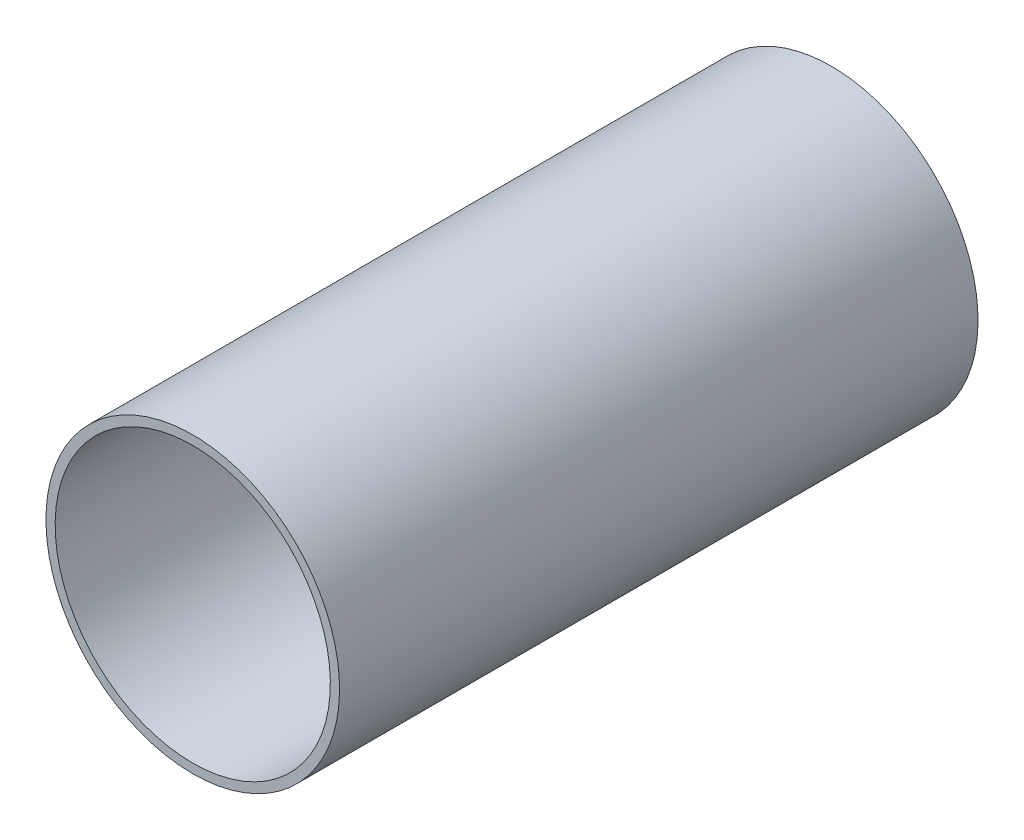
ISO-10303-21;
HEADER;
FILE_DESCRIPTION(('STEP AP214'),'2;1');
FILE_NAME('part.step','',(''),(''),'','','');
FILE_SCHEMA(('AUTOMOTIVE_DESIGN { 1 0 10303 214 1 1 1 1 }'));
ENDSEC;
DATA;
#1=APPLICATION_CONTEXT('core data for automotive mechanical design processes');
#2=APPLICATION_PROTOCOL_DEFINITION('international standard','automotive_design',2000,#1);
#3=PRODUCT_CONTEXT('',#1,'mechanical');
#4=PRODUCT('Part','Part','',(#3));
#5=PRODUCT_RELATED_PRODUCT_CATEGORY('part','',(#4));
#6=PRODUCT_DEFINITION_FORMATION('','',#4);
#7=PRODUCT_DEFINITION_CONTEXT('part definition',#1,'design');
#8=PRODUCT_DEFINITION('design','',#6,#7);
#9=PRODUCT_DEFINITION_SHAPE('','',#8);
#10=(LENGTH_UNIT() NAMED_UNIT(*) SI_UNIT(.MILLI.,.METRE.));
#11=(NAMED_UNIT(*) PLANE_ANGLE_UNIT() SI_UNIT($,.RADIAN.));
#12=(NAMED_UNIT(*) SI_UNIT($,.STERADIAN.) SOLID_ANGLE_UNIT());
#13=UNCERTAINTY_MEASURE_WITH_UNIT(LENGTH_MEASURE(1.E-05),#10,'distance_accuracy_value','');
#14=(GEOMETRIC_REPRESENTATION_CONTEXT(3) GLOBAL_UNCERTAINTY_ASSIGNED_CONTEXT((#13)) GLOBAL_UNIT_ASSIGNED_CONTEXT((#10,
#11,#12)) REPRESENTATION_CONTEXT('',''));
#15=CARTESIAN_POINT('',(0.,0.,0.));
#16=DIRECTION('',(0.,0.,1.));
#17=DIRECTION('',(1.,0.,0.));
#18=AXIS2_PLACEMENT_3D('',#15,#16,#17);
#19=CARTESIAN_POINT('',(144.78,-103.632,-0.045));
#20=DIRECTION('',(0.,0.,-1.));
#21=DIRECTION('',(0.,-1.,0.));
#22=AXIS2_PLACEMENT_3D('',#19,#20,#21);
#23=CYLINDRICAL_SURFACE('',#22,0.375);
#24=CARTESIAN_POINT('',(144.78,-103.632,-0.035));
#25=DIRECTION('',(0.,0.,-1.));
#26=DIRECTION('',(0.,-1.,0.));
#27=AXIS2_PLACEMENT_3D('',#24,#25,#26);
#28=CIRCLE('',#27,0.375);
#29=CARTESIAN_POINT('',(144.78,-104.007,-0.035));
#30=VERTEX_POINT('',#29);
#31=EDGE_CURVE('E64',#30,#30,#28,.T.);
#32=ORIENTED_EDGE('',*,*,#31,.T.);
#33=DIRECTION('',(0.,0.,1.));
#34=VECTOR('',#33,1.);
#35=CARTESIAN_POINT('',(144.78,-104.007,-0.045));
#36=LINE('',#35,#34);
#37=CARTESIAN_POINT('',(144.78,-104.007,1.705));
#38=VERTEX_POINT('',#37);
#39=EDGE_CURVE('E11',#30,#38,#36,.T.);
#40=ORIENTED_EDGE('',*,*,#39,.T.);
#41=CARTESIAN_POINT('',(144.78,-103.632,1.705));
#42=DIRECTION('',(0.,0.,-1.));
#43=DIRECTION('',(0.,-1.,0.));
#44=AXIS2_PLACEMENT_3D('',#41,#42,#43);
#45=CIRCLE('',#44,0.375);
#46=EDGE_CURVE('E25',#38,#38,#45,.T.);
#47=ORIENTED_EDGE('',*,*,#46,.F.);
#48=ORIENTED_EDGE('',*,*,#39,.F.);
#49=EDGE_LOOP('',(#32,#40,#47,#48));
#50=FACE_BOUND('',#49,.T.);
#51=ADVANCED_FACE('F17',(#50),#23,.F.);
#52=CARTESIAN_POINT('',(144.78,-104.032,1.705));
#53=DIRECTION('',(0.,0.,1.));
#54=DIRECTION('',(1.,0.,0.));
#55=AXIS2_PLACEMENT_3D('',#52,#53,#54);
#56=PLANE('',#55);
#57=ORIENTED_EDGE('',*,*,#46,.T.);
#58=EDGE_LOOP('',(#57));
#59=FACE_BOUND('',#58,.T.);
#60=CARTESIAN_POINT('',(144.78,-103.632,1.705));
#61=DIRECTION('',(0.,0.,1.));
#62=DIRECTION('',(0.,-1.,0.));
#63=AXIS2_PLACEMENT_3D('',#60,#61,#62);
#64=CIRCLE('',#63,0.4);
#65=CARTESIAN_POINT('',(144.78,-104.032,1.705));
#66=VERTEX_POINT('',#65);
#67=EDGE_CURVE('E56',#66,#66,#64,.T.);
#68=ORIENTED_EDGE('',*,*,#67,.T.);
#69=EDGE_LOOP('',(#68));
#70=FACE_BOUND('',#69,.T.);
#71=ADVANCED_FACE('F73',(#59,#70),#56,.T.);
#72=CARTESIAN_POINT('',(144.78,-104.032,-0.035));
#73=DIRECTION('',(0.,0.,1.));
#74=DIRECTION('',(1.,0.,0.));
#75=AXIS2_PLACEMENT_3D('',#72,#73,#74);
#76=PLANE('',#75);
#77=ORIENTED_EDGE('',*,*,#31,.F.);
#78=EDGE_LOOP('',(#77));
#79=FACE_BOUND('',#78,.T.);
#80=CARTESIAN_POINT('',(144.78,-103.632,-0.035));
#81=DIRECTION('',(0.,0.,1.));
#82=DIRECTION('',(0.,-1.,0.));
#83=AXIS2_PLACEMENT_3D('',#80,#81,#82);
#84=CIRCLE('',#83,0.4);
#85=CARTESIAN_POINT('',(144.78,-104.032,-0.035));
#86=VERTEX_POINT('',#85);
#87=EDGE_CURVE('E55',#86,#86,#84,.T.);
#88=ORIENTED_EDGE('',*,*,#87,.F.);
#89=EDGE_LOOP('',(#88));
#90=FACE_BOUND('',#89,.T.);
#91=ADVANCED_FACE('F82',(#79,#90),#76,.F.);
#92=CARTESIAN_POINT('',(144.78,-103.632,-0.035));
#93=DIRECTION('',(0.,0.,-1.));
#94=DIRECTION('',(0.,-1.,0.));
#95=AXIS2_PLACEMENT_3D('',#92,#93,#94);
#96=CYLINDRICAL_SURFACE('',#95,0.4);
#97=ORIENTED_EDGE('',*,*,#87,.T.);
#98=DIRECTION('',(0.,0.,1.));
#99=VECTOR('',#98,1.);
#100=CARTESIAN_POINT('',(144.78,-104.032,-0.035));
#101=LINE('',#100,#99);
#102=EDGE_CURVE('E52',#86,#66,#101,.T.);
#103=ORIENTED_EDGE('',*,*,#102,.T.);
#104=ORIENTED_EDGE('',*,*,#67,.F.);
#105=ORIENTED_EDGE('',*,*,#102,.F.);
#106=EDGE_LOOP('',(#97,#103,#104,#105));
#107=FACE_BOUND('',#106,.T.);
#108=ADVANCED_FACE('F53',(#107),#96,.T.);
#109=CLOSED_SHELL('',(#51,#71,#91,#108));
#110=MANIFOLD_SOLID_BREP('B1',#109);
#111=ADVANCED_BREP_SHAPE_REPRESENTATION('',(#18,#110),#14);
#112=SHAPE_DEFINITION_REPRESENTATION(#9,#111);
ENDSEC;
END-ISO-10303-21;
